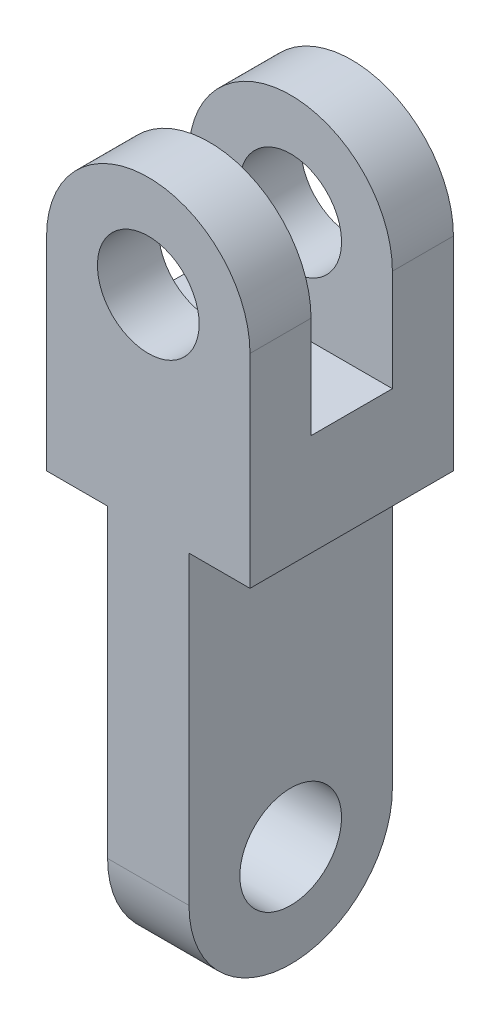
ISO-10303-21;
HEADER;
FILE_DESCRIPTION(('STEP AP214'),'2;1');
FILE_NAME('part.step','',(''),(''),'','','');
FILE_SCHEMA(('AUTOMOTIVE_DESIGN { 1 0 10303 214 1 1 1 1 }'));
ENDSEC;
DATA;
#1=APPLICATION_CONTEXT('core data for automotive mechanical design processes');
#2=APPLICATION_PROTOCOL_DEFINITION('international standard','automotive_design',2000,#1);
#3=PRODUCT_CONTEXT('',#1,'mechanical');
#4=PRODUCT('Part','Part','',(#3));
#5=PRODUCT_RELATED_PRODUCT_CATEGORY('part','',(#4));
#6=PRODUCT_DEFINITION_FORMATION('','',#4);
#7=PRODUCT_DEFINITION_CONTEXT('part definition',#1,'design');
#8=PRODUCT_DEFINITION('design','',#6,#7);
#9=PRODUCT_DEFINITION_SHAPE('','',#8);
#10=(LENGTH_UNIT() NAMED_UNIT(*) SI_UNIT(.MILLI.,.METRE.));
#11=(NAMED_UNIT(*) PLANE_ANGLE_UNIT() SI_UNIT($,.RADIAN.));
#12=(NAMED_UNIT(*) SI_UNIT($,.STERADIAN.) SOLID_ANGLE_UNIT());
#13=UNCERTAINTY_MEASURE_WITH_UNIT(LENGTH_MEASURE(1.E-05),#10,'distance_accuracy_value','');
#14=(GEOMETRIC_REPRESENTATION_CONTEXT(3) GLOBAL_UNCERTAINTY_ASSIGNED_CONTEXT((#13)) GLOBAL_UNIT_ASSIGNED_CONTEXT((#10,
#11,#12)) REPRESENTATION_CONTEXT('',''));
#15=CARTESIAN_POINT('',(0.,0.,0.));
#16=DIRECTION('',(0.,0.,1.));
#17=DIRECTION('',(1.,0.,0.));
#18=AXIS2_PLACEMENT_3D('',#15,#16,#17);
#19=CARTESIAN_POINT('',(-50.,0.,50.));
#20=DIRECTION('',(0.,1.,0.));
#21=DIRECTION('',(-1.,0.,0.));
#22=AXIS2_PLACEMENT_3D('',#19,#20,#21);
#23=PLANE('',#22);
#24=DIRECTION('',(0.,0.,1.));
#25=VECTOR('',#24,1.);
#26=CARTESIAN_POINT('',(20.,0.,-50.));
#27=LINE('',#26,#25);
#28=CARTESIAN_POINT('',(20.,0.,-50.));
#29=VERTEX_POINT('',#28);
#30=CARTESIAN_POINT('',(20.,0.,50.));
#31=VERTEX_POINT('',#30);
#32=EDGE_CURVE('E56',#29,#31,#27,.T.);
#33=ORIENTED_EDGE('',*,*,#32,.F.);
#34=DIRECTION('',(1.,0.,0.));
#35=VECTOR('',#34,1.);
#36=CARTESIAN_POINT('',(-50.,0.,-50.));
#37=LINE('',#36,#35);
#38=CARTESIAN_POINT('',(50.,0.,-50.));
#39=VERTEX_POINT('',#38);
#40=EDGE_CURVE('E215',#29,#39,#37,.T.);
#41=ORIENTED_EDGE('',*,*,#40,.T.);
#42=DIRECTION('',(0.,0.,-1.));
#43=VECTOR('',#42,1.);
#44=CARTESIAN_POINT('',(50.,0.,50.));
#45=LINE('',#44,#43);
#46=CARTESIAN_POINT('',(50.,0.,50.));
#47=VERTEX_POINT('',#46);
#48=EDGE_CURVE('E124',#47,#39,#45,.T.);
#49=ORIENTED_EDGE('',*,*,#48,.F.);
#50=DIRECTION('',(1.,0.,0.));
#51=VECTOR('',#50,1.);
#52=CARTESIAN_POINT('',(-50.,0.,50.));
#53=LINE('',#52,#51);
#54=EDGE_CURVE('E121',#31,#47,#53,.T.);
#55=ORIENTED_EDGE('',*,*,#54,.F.);
#56=EDGE_LOOP('',(#33,#41,#49,#55));
#57=FACE_BOUND('',#56,.T.);
#58=ADVANCED_FACE('F33',(#57),#23,.F.);
#59=CARTESIAN_POINT('',(0.,100.,50.));
#60=DIRECTION('',(0.,0.,-1.));
#61=DIRECTION('',(-1.,0.,0.));
#62=AXIS2_PLACEMENT_3D('',#59,#60,#61);
#63=CYLINDRICAL_SURFACE('',#62,50.);
#64=DIRECTION('',(0.,0.,-1.));
#65=VECTOR('',#64,1.);
#66=CARTESIAN_POINT('',(-50.,100.,50.));
#67=LINE('',#66,#65);
#68=CARTESIAN_POINT('',(-50.,100.,-20.));
#69=VERTEX_POINT('',#68);
#70=CARTESIAN_POINT('',(-50.,100.,-50.));
#71=VERTEX_POINT('',#70);
#72=EDGE_CURVE('E220',#69,#71,#67,.T.);
#73=ORIENTED_EDGE('',*,*,#72,.F.);
#74=CARTESIAN_POINT('',(0.,100.,-20.));
#75=DIRECTION('',(0.,0.,-1.));
#76=DIRECTION('',(-1.,0.,0.));
#77=AXIS2_PLACEMENT_3D('',#74,#75,#76);
#78=CIRCLE('',#77,50.);
#79=CARTESIAN_POINT('',(50.,100.,-20.));
#80=VERTEX_POINT('',#79);
#81=EDGE_CURVE('E168',#80,#69,#78,.F.);
#82=ORIENTED_EDGE('',*,*,#81,.F.);
#83=DIRECTION('',(0.,0.,-1.));
#84=VECTOR('',#83,1.);
#85=CARTESIAN_POINT('',(50.,100.,50.));
#86=LINE('',#85,#84);
#87=CARTESIAN_POINT('',(50.,100.,-50.));
#88=VERTEX_POINT('',#87);
#89=EDGE_CURVE('E41',#80,#88,#86,.T.);
#90=ORIENTED_EDGE('',*,*,#89,.T.);
#91=CARTESIAN_POINT('',(0.,100.,-50.));
#92=DIRECTION('',(0.,0.,1.));
#93=DIRECTION('',(1.,0.,0.));
#94=AXIS2_PLACEMENT_3D('',#91,#92,#93);
#95=CIRCLE('',#94,50.);
#96=EDGE_CURVE('E210',#88,#71,#95,.T.);
#97=ORIENTED_EDGE('',*,*,#96,.T.);
#98=EDGE_LOOP('',(#73,#82,#90,#97));
#99=FACE_BOUND('',#98,.T.);
#100=ADVANCED_FACE('F236',(#99),#63,.T.);
#101=CARTESIAN_POINT('',(0.,100.,50.));
#102=DIRECTION('',(0.,0.,-1.));
#103=DIRECTION('',(-1.,0.,0.));
#104=AXIS2_PLACEMENT_3D('',#101,#102,#103);
#105=CYLINDRICAL_SURFACE('',#104,25.);
#106=CARTESIAN_POINT('',(0.,100.,-20.));
#107=DIRECTION('',(0.,0.,-1.));
#108=DIRECTION('',(-1.,0.,0.));
#109=AXIS2_PLACEMENT_3D('',#106,#107,#108);
#110=CIRCLE('',#109,25.);
#111=CARTESIAN_POINT('',(-25.,100.,-20.));
#112=VERTEX_POINT('',#111);
#113=EDGE_CURVE('E171',#112,#112,#110,.F.);
#114=ORIENTED_EDGE('',*,*,#113,.T.);
#115=EDGE_LOOP('',(#114));
#116=FACE_BOUND('',#115,.T.);
#117=CARTESIAN_POINT('',(0.,100.,-50.));
#118=DIRECTION('',(0.,0.,1.));
#119=DIRECTION('',(1.,0.,0.));
#120=AXIS2_PLACEMENT_3D('',#117,#118,#119);
#121=CIRCLE('',#120,25.);
#122=CARTESIAN_POINT('',(25.,100.,-50.));
#123=VERTEX_POINT('',#122);
#124=EDGE_CURVE('E195',#123,#123,#121,.T.);
#125=ORIENTED_EDGE('',*,*,#124,.F.);
#126=EDGE_LOOP('',(#125));
#127=FACE_BOUND('',#126,.T.);
#128=ADVANCED_FACE('F284',(#116,#127),#105,.F.);
#129=CARTESIAN_POINT('',(0.,100.,50.));
#130=DIRECTION('',(0.,0.,1.));
#131=DIRECTION('',(1.,0.,0.));
#132=AXIS2_PLACEMENT_3D('',#129,#130,#131);
#133=PLANE('',#132);
#134=DIRECTION('',(0.,1.,0.));
#135=VECTOR('',#134,1.);
#136=CARTESIAN_POINT('',(50.,0.,50.));
#137=LINE('',#136,#135);
#138=CARTESIAN_POINT('',(50.,100.,50.));
#139=VERTEX_POINT('',#138);
#140=EDGE_CURVE('E202',#47,#139,#137,.T.);
#141=ORIENTED_EDGE('',*,*,#140,.T.);
#142=CARTESIAN_POINT('',(0.,100.,50.));
#143=DIRECTION('',(0.,0.,1.));
#144=DIRECTION('',(1.,0.,0.));
#145=AXIS2_PLACEMENT_3D('',#142,#143,#144);
#146=CIRCLE('',#145,50.);
#147=CARTESIAN_POINT('',(-50.,100.,50.));
#148=VERTEX_POINT('',#147);
#149=EDGE_CURVE('E204',#139,#148,#146,.T.);
#150=ORIENTED_EDGE('',*,*,#149,.T.);
#151=DIRECTION('',(0.,-1.,0.));
#152=VECTOR('',#151,1.);
#153=CARTESIAN_POINT('',(-50.,100.,50.));
#154=LINE('',#153,#152);
#155=CARTESIAN_POINT('',(-50.,0.,50.));
#156=VERTEX_POINT('',#155);
#157=EDGE_CURVE('E129',#148,#156,#154,.T.);
#158=ORIENTED_EDGE('',*,*,#157,.T.);
#159=CARTESIAN_POINT('',(-20.,0.,50.));
#160=VERTEX_POINT('',#159);
#161=EDGE_CURVE('E128',#156,#160,#53,.T.);
#162=ORIENTED_EDGE('',*,*,#161,.T.);
#163=DIRECTION('',(0.,-1.,0.));
#164=VECTOR('',#163,1.);
#165=CARTESIAN_POINT('',(-20.,0.,50.));
#166=LINE('',#165,#164);
#167=CARTESIAN_POINT('',(-20.,-150.,50.));
#168=VERTEX_POINT('',#167);
#169=EDGE_CURVE('E159',#160,#168,#166,.T.);
#170=ORIENTED_EDGE('',*,*,#169,.T.);
#171=DIRECTION('',(-1.,0.,0.));
#172=VECTOR('',#171,1.);
#173=CARTESIAN_POINT('',(20.,-150.,50.));
#174=LINE('',#173,#172);
#175=CARTESIAN_POINT('',(20.,-150.,50.));
#176=VERTEX_POINT('',#175);
#177=EDGE_CURVE('E136',#176,#168,#174,.T.);
#178=ORIENTED_EDGE('',*,*,#177,.F.);
#179=DIRECTION('',(0.,-1.,0.));
#180=VECTOR('',#179,1.);
#181=CARTESIAN_POINT('',(20.,0.,50.));
#182=LINE('',#181,#180);
#183=EDGE_CURVE('E132',#31,#176,#182,.T.);
#184=ORIENTED_EDGE('',*,*,#183,.F.);
#185=ORIENTED_EDGE('',*,*,#54,.T.);
#186=EDGE_LOOP('',(#141,#150,#158,#162,#170,#178,#184,#185));
#187=FACE_BOUND('',#186,.T.);
#188=CARTESIAN_POINT('',(0.,100.,50.));
#189=DIRECTION('',(0.,0.,1.));
#190=DIRECTION('',(1.,0.,0.));
#191=AXIS2_PLACEMENT_3D('',#188,#189,#190);
#192=CIRCLE('',#191,25.);
#193=CARTESIAN_POINT('',(25.,100.,50.));
#194=VERTEX_POINT('',#193);
#195=EDGE_CURVE('E196',#194,#194,#192,.T.);
#196=ORIENTED_EDGE('',*,*,#195,.F.);
#197=EDGE_LOOP('',(#196));
#198=FACE_BOUND('',#197,.T.);
#199=ADVANCED_FACE('F133',(#187,#198),#133,.T.);
#200=CARTESIAN_POINT('',(0.,100.,-50.));
#201=DIRECTION('',(0.,0.,1.));
#202=DIRECTION('',(1.,0.,0.));
#203=AXIS2_PLACEMENT_3D('',#200,#201,#202);
#204=PLANE('',#203);
#205=DIRECTION('',(0.,1.,0.));
#206=VECTOR('',#205,1.);
#207=CARTESIAN_POINT('',(50.,0.,-50.));
#208=LINE('',#207,#206);
#209=EDGE_CURVE('E199',#39,#88,#208,.T.);
#210=ORIENTED_EDGE('',*,*,#209,.F.);
#211=ORIENTED_EDGE('',*,*,#40,.F.);
#212=DIRECTION('',(0.,1.,0.));
#213=VECTOR('',#212,1.);
#214=CARTESIAN_POINT('',(20.,-150.,-50.));
#215=LINE('',#214,#213);
#216=CARTESIAN_POINT('',(20.,-150.,-50.));
#217=VERTEX_POINT('',#216);
#218=EDGE_CURVE('E145',#217,#29,#215,.T.);
#219=ORIENTED_EDGE('',*,*,#218,.F.);
#220=DIRECTION('',(-1.,0.,0.));
#221=VECTOR('',#220,1.);
#222=CARTESIAN_POINT('',(20.,-150.,-50.));
#223=LINE('',#222,#221);
#224=CARTESIAN_POINT('',(-20.,-150.,-50.));
#225=VERTEX_POINT('',#224);
#226=EDGE_CURVE('E157',#217,#225,#223,.T.);
#227=ORIENTED_EDGE('',*,*,#226,.T.);
#228=DIRECTION('',(0.,1.,0.));
#229=VECTOR('',#228,1.);
#230=CARTESIAN_POINT('',(-20.,-150.,-50.));
#231=LINE('',#230,#229);
#232=CARTESIAN_POINT('',(-20.,0.,-50.));
#233=VERTEX_POINT('',#232);
#234=EDGE_CURVE('E146',#225,#233,#231,.T.);
#235=ORIENTED_EDGE('',*,*,#234,.T.);
#236=CARTESIAN_POINT('',(-50.,0.,-50.));
#237=VERTEX_POINT('',#236);
#238=EDGE_CURVE('E205',#237,#233,#37,.T.);
#239=ORIENTED_EDGE('',*,*,#238,.F.);
#240=DIRECTION('',(0.,-1.,0.));
#241=VECTOR('',#240,1.);
#242=CARTESIAN_POINT('',(-50.,100.,-50.));
#243=LINE('',#242,#241);
#244=EDGE_CURVE('E213',#71,#237,#243,.T.);
#245=ORIENTED_EDGE('',*,*,#244,.F.);
#246=ORIENTED_EDGE('',*,*,#96,.F.);
#247=EDGE_LOOP('',(#210,#211,#219,#227,#235,#239,#245,#246));
#248=FACE_BOUND('',#247,.T.);
#249=ORIENTED_EDGE('',*,*,#124,.T.);
#250=EDGE_LOOP('',(#249));
#251=FACE_BOUND('',#250,.T.);
#252=ADVANCED_FACE('F241',(#248,#251),#204,.F.);
#253=CARTESIAN_POINT('',(50.,0.,50.));
#254=DIRECTION('',(-1.,0.,0.));
#255=DIRECTION('',(0.,-1.,0.));
#256=AXIS2_PLACEMENT_3D('',#253,#254,#255);
#257=PLANE('',#256);
#258=ORIENTED_EDGE('',*,*,#89,.F.);
#259=DIRECTION('',(0.,1.,0.));
#260=VECTOR('',#259,1.);
#261=CARTESIAN_POINT('',(50.,50.,-20.));
#262=LINE('',#261,#260);
#263=CARTESIAN_POINT('',(50.,50.,-20.));
#264=VERTEX_POINT('',#263);
#265=EDGE_CURVE('E185',#264,#80,#262,.T.);
#266=ORIENTED_EDGE('',*,*,#265,.F.);
#267=DIRECTION('',(0.,0.,-1.));
#268=VECTOR('',#267,1.);
#269=CARTESIAN_POINT('',(50.,50.,20.));
#270=LINE('',#269,#268);
#271=CARTESIAN_POINT('',(50.,50.,20.));
#272=VERTEX_POINT('',#271);
#273=EDGE_CURVE('E182',#272,#264,#270,.T.);
#274=ORIENTED_EDGE('',*,*,#273,.F.);
#275=DIRECTION('',(0.,-1.,0.));
#276=VECTOR('',#275,1.);
#277=CARTESIAN_POINT('',(50.,150.,20.));
#278=LINE('',#277,#276);
#279=CARTESIAN_POINT('',(50.,100.,20.));
#280=VERTEX_POINT('',#279);
#281=EDGE_CURVE('E179',#280,#272,#278,.T.);
#282=ORIENTED_EDGE('',*,*,#281,.F.);
#283=EDGE_CURVE('E11',#139,#280,#86,.T.);
#284=ORIENTED_EDGE('',*,*,#283,.F.);
#285=ORIENTED_EDGE('',*,*,#140,.F.);
#286=ORIENTED_EDGE('',*,*,#48,.T.);
#287=ORIENTED_EDGE('',*,*,#209,.T.);
#288=EDGE_LOOP('',(#258,#266,#274,#282,#284,#285,#286,#287));
#289=FACE_BOUND('',#288,.T.);
#290=ADVANCED_FACE('F35',(#289),#257,.F.);
#291=ORIENTED_EDGE('',*,*,#283,.T.);
#292=CARTESIAN_POINT('',(0.,100.,20.));
#293=DIRECTION('',(0.,0.,1.));
#294=DIRECTION('',(1.,0.,0.));
#295=AXIS2_PLACEMENT_3D('',#292,#293,#294);
#296=CIRCLE('',#295,50.);
#297=CARTESIAN_POINT('',(-50.,100.,20.));
#298=VERTEX_POINT('',#297);
#299=EDGE_CURVE('E166',#298,#280,#296,.F.);
#300=ORIENTED_EDGE('',*,*,#299,.F.);
#301=EDGE_CURVE('E221',#148,#298,#67,.T.);
#302=ORIENTED_EDGE('',*,*,#301,.F.);
#303=ORIENTED_EDGE('',*,*,#149,.F.);
#304=EDGE_LOOP('',(#291,#300,#302,#303));
#305=FACE_BOUND('',#304,.T.);
#306=ADVANCED_FACE('F249',(#305),#63,.T.);
#307=CARTESIAN_POINT('',(-50.,100.,50.));
#308=DIRECTION('',(1.,0.,0.));
#309=DIRECTION('',(0.,1.,0.));
#310=AXIS2_PLACEMENT_3D('',#307,#308,#309);
#311=PLANE('',#310);
#312=DIRECTION('',(0.,0.,1.));
#313=VECTOR('',#312,1.);
#314=CARTESIAN_POINT('',(-50.,50.,20.));
#315=LINE('',#314,#313);
#316=CARTESIAN_POINT('',(-50.,50.,-20.));
#317=VERTEX_POINT('',#316);
#318=CARTESIAN_POINT('',(-50.,50.,20.));
#319=VERTEX_POINT('',#318);
#320=EDGE_CURVE('E174',#317,#319,#315,.T.);
#321=ORIENTED_EDGE('',*,*,#320,.F.);
#322=DIRECTION('',(0.,-1.,0.));
#323=VECTOR('',#322,1.);
#324=CARTESIAN_POINT('',(-50.,50.,-20.));
#325=LINE('',#324,#323);
#326=EDGE_CURVE('E177',#69,#317,#325,.T.);
#327=ORIENTED_EDGE('',*,*,#326,.F.);
#328=ORIENTED_EDGE('',*,*,#72,.T.);
#329=ORIENTED_EDGE('',*,*,#244,.T.);
#330=DIRECTION('',(0.,0.,-1.));
#331=VECTOR('',#330,1.);
#332=CARTESIAN_POINT('',(-50.,0.,50.));
#333=LINE('',#332,#331);
#334=EDGE_CURVE('E218',#156,#237,#333,.T.);
#335=ORIENTED_EDGE('',*,*,#334,.F.);
#336=ORIENTED_EDGE('',*,*,#157,.F.);
#337=ORIENTED_EDGE('',*,*,#301,.T.);
#338=DIRECTION('',(0.,1.,0.));
#339=VECTOR('',#338,1.);
#340=CARTESIAN_POINT('',(-50.,150.,20.));
#341=LINE('',#340,#339);
#342=EDGE_CURVE('E190',#319,#298,#341,.T.);
#343=ORIENTED_EDGE('',*,*,#342,.F.);
#344=EDGE_LOOP('',(#321,#327,#328,#329,#335,#336,#337,#343));
#345=FACE_BOUND('',#344,.T.);
#346=ADVANCED_FACE('F230',(#345),#311,.F.);
#347=ORIENTED_EDGE('',*,*,#238,.T.);
#348=DIRECTION('',(0.,0.,1.));
#349=VECTOR('',#348,1.);
#350=CARTESIAN_POINT('',(-20.,0.,-50.));
#351=LINE('',#350,#349);
#352=EDGE_CURVE('E48',#233,#160,#351,.T.);
#353=ORIENTED_EDGE('',*,*,#352,.T.);
#354=ORIENTED_EDGE('',*,*,#161,.F.);
#355=ORIENTED_EDGE('',*,*,#334,.T.);
#356=EDGE_LOOP('',(#347,#353,#354,#355));
#357=FACE_BOUND('',#356,.T.);
#358=ADVANCED_FACE('F244',(#357),#23,.F.);
#359=CARTESIAN_POINT('',(0.,100.,20.));
#360=DIRECTION('',(0.,0.,1.));
#361=DIRECTION('',(1.,0.,0.));
#362=AXIS2_PLACEMENT_3D('',#359,#360,#361);
#363=CIRCLE('',#362,25.);
#364=CARTESIAN_POINT('',(25.,100.,20.));
#365=VERTEX_POINT('',#364);
#366=EDGE_CURVE('E170',#365,#365,#363,.F.);
#367=ORIENTED_EDGE('',*,*,#366,.T.);
#368=EDGE_LOOP('',(#367));
#369=FACE_BOUND('',#368,.T.);
#370=ORIENTED_EDGE('',*,*,#195,.T.);
#371=EDGE_LOOP('',(#370));
#372=FACE_BOUND('',#371,.T.);
#373=ADVANCED_FACE('F288',(#369,#372),#105,.F.);
#374=CARTESIAN_POINT('',(-50.0010000000001,50.,-20.));
#375=DIRECTION('',(0.,0.,-1.));
#376=DIRECTION('',(-1.,0.,0.));
#377=AXIS2_PLACEMENT_3D('',#374,#375,#376);
#378=PLANE('',#377);
#379=ORIENTED_EDGE('',*,*,#113,.F.);
#380=EDGE_LOOP('',(#379));
#381=FACE_BOUND('',#380,.T.);
#382=ORIENTED_EDGE('',*,*,#81,.T.);
#383=ORIENTED_EDGE('',*,*,#326,.T.);
#384=DIRECTION('',(1.,0.,0.));
#385=VECTOR('',#384,1.);
#386=CARTESIAN_POINT('',(-50.0010000000001,50.,-20.));
#387=LINE('',#386,#385);
#388=EDGE_CURVE('E188',#317,#264,#387,.T.);
#389=ORIENTED_EDGE('',*,*,#388,.T.);
#390=ORIENTED_EDGE('',*,*,#265,.T.);
#391=EDGE_LOOP('',(#382,#383,#389,#390));
#392=FACE_BOUND('',#391,.T.);
#393=ADVANCED_FACE('F260',(#381,#392),#378,.F.);
#394=CARTESIAN_POINT('',(-50.0010000000001,50.,20.));
#395=DIRECTION('',(0.,-1.,0.));
#396=DIRECTION('',(1.,0.,0.));
#397=AXIS2_PLACEMENT_3D('',#394,#395,#396);
#398=PLANE('',#397);
#399=ORIENTED_EDGE('',*,*,#320,.T.);
#400=DIRECTION('',(1.,0.,0.));
#401=VECTOR('',#400,1.);
#402=CARTESIAN_POINT('',(-50.0010000000001,50.,20.));
#403=LINE('',#402,#401);
#404=EDGE_CURVE('E187',#319,#272,#403,.T.);
#405=ORIENTED_EDGE('',*,*,#404,.T.);
#406=ORIENTED_EDGE('',*,*,#273,.T.);
#407=ORIENTED_EDGE('',*,*,#388,.F.);
#408=EDGE_LOOP('',(#399,#405,#406,#407));
#409=FACE_BOUND('',#408,.T.);
#410=ADVANCED_FACE('F258',(#409),#398,.F.);
#411=CARTESIAN_POINT('',(-50.0010000000001,150.,20.));
#412=DIRECTION('',(0.,0.,1.));
#413=DIRECTION('',(1.,0.,0.));
#414=AXIS2_PLACEMENT_3D('',#411,#412,#413);
#415=PLANE('',#414);
#416=ORIENTED_EDGE('',*,*,#366,.F.);
#417=EDGE_LOOP('',(#416));
#418=FACE_BOUND('',#417,.T.);
#419=ORIENTED_EDGE('',*,*,#281,.T.);
#420=ORIENTED_EDGE('',*,*,#404,.F.);
#421=ORIENTED_EDGE('',*,*,#342,.T.);
#422=ORIENTED_EDGE('',*,*,#299,.T.);
#423=EDGE_LOOP('',(#419,#420,#421,#422));
#424=FACE_BOUND('',#423,.T.);
#425=ADVANCED_FACE('F252',(#418,#424),#415,.F.);
#426=CARTESIAN_POINT('',(20.,-150.,0.));
#427=DIRECTION('',(1.,0.,0.));
#428=DIRECTION('',(0.,0.,-1.));
#429=AXIS2_PLACEMENT_3D('',#426,#427,#428);
#430=PLANE('',#429);
#431=ORIENTED_EDGE('',*,*,#32,.T.);
#432=ORIENTED_EDGE('',*,*,#183,.T.);
#433=CARTESIAN_POINT('',(20.,-150.,0.));
#434=DIRECTION('',(1.,0.,0.));
#435=DIRECTION('',(0.,0.,-1.));
#436=AXIS2_PLACEMENT_3D('',#433,#434,#435);
#437=CIRCLE('',#436,50.);
#438=EDGE_CURVE('E139',#176,#217,#437,.T.);
#439=ORIENTED_EDGE('',*,*,#438,.T.);
#440=ORIENTED_EDGE('',*,*,#218,.T.);
#441=EDGE_LOOP('',(#431,#432,#439,#440));
#442=FACE_BOUND('',#441,.T.);
#443=CARTESIAN_POINT('',(20.,-150.,0.));
#444=DIRECTION('',(1.,0.,0.));
#445=DIRECTION('',(0.,0.,-1.));
#446=AXIS2_PLACEMENT_3D('',#443,#444,#445);
#447=CIRCLE('',#446,25.);
#448=CARTESIAN_POINT('',(20.,-150.,-25.));
#449=VERTEX_POINT('',#448);
#450=EDGE_CURVE('E160',#449,#449,#447,.T.);
#451=ORIENTED_EDGE('',*,*,#450,.F.);
#452=EDGE_LOOP('',(#451));
#453=FACE_BOUND('',#452,.T.);
#454=ADVANCED_FACE('F142',(#442,#453),#430,.T.);
#455=CARTESIAN_POINT('',(-20.,-150.,0.));
#456=DIRECTION('',(1.,0.,0.));
#457=DIRECTION('',(0.,0.,-1.));
#458=AXIS2_PLACEMENT_3D('',#455,#456,#457);
#459=PLANE('',#458);
#460=ORIENTED_EDGE('',*,*,#352,.F.);
#461=ORIENTED_EDGE('',*,*,#234,.F.);
#462=CARTESIAN_POINT('',(-20.,-150.,0.));
#463=DIRECTION('',(1.,0.,0.));
#464=DIRECTION('',(0.,0.,-1.));
#465=AXIS2_PLACEMENT_3D('',#462,#463,#464);
#466=CIRCLE('',#465,50.);
#467=EDGE_CURVE('E149',#168,#225,#466,.T.);
#468=ORIENTED_EDGE('',*,*,#467,.F.);
#469=ORIENTED_EDGE('',*,*,#169,.F.);
#470=EDGE_LOOP('',(#460,#461,#468,#469));
#471=FACE_BOUND('',#470,.T.);
#472=CARTESIAN_POINT('',(-20.,-150.,0.));
#473=DIRECTION('',(1.,0.,0.));
#474=DIRECTION('',(0.,0.,-1.));
#475=AXIS2_PLACEMENT_3D('',#472,#473,#474);
#476=CIRCLE('',#475,25.);
#477=CARTESIAN_POINT('',(-20.,-150.,-25.));
#478=VERTEX_POINT('',#477);
#479=EDGE_CURVE('E152',#478,#478,#476,.T.);
#480=ORIENTED_EDGE('',*,*,#479,.T.);
#481=EDGE_LOOP('',(#480));
#482=FACE_BOUND('',#481,.T.);
#483=ADVANCED_FACE('F265',(#471,#482),#459,.F.);
#484=CARTESIAN_POINT('',(20.,-150.,0.));
#485=DIRECTION('',(-1.,0.,0.));
#486=DIRECTION('',(0.,0.,1.));
#487=AXIS2_PLACEMENT_3D('',#484,#485,#486);
#488=CYLINDRICAL_SURFACE('',#487,50.);
#489=ORIENTED_EDGE('',*,*,#467,.T.);
#490=ORIENTED_EDGE('',*,*,#226,.F.);
#491=ORIENTED_EDGE('',*,*,#438,.F.);
#492=ORIENTED_EDGE('',*,*,#177,.T.);
#493=EDGE_LOOP('',(#489,#490,#491,#492));
#494=FACE_BOUND('',#493,.T.);
#495=ADVANCED_FACE('F267',(#494),#488,.T.);
#496=CARTESIAN_POINT('',(20.,-150.,0.));
#497=DIRECTION('',(-1.,0.,0.));
#498=DIRECTION('',(0.,0.,1.));
#499=AXIS2_PLACEMENT_3D('',#496,#497,#498);
#500=CYLINDRICAL_SURFACE('',#499,25.);
#501=ORIENTED_EDGE('',*,*,#450,.T.);
#502=EDGE_LOOP('',(#501));
#503=FACE_BOUND('',#502,.T.);
#504=ORIENTED_EDGE('',*,*,#479,.F.);
#505=EDGE_LOOP('',(#504));
#506=FACE_BOUND('',#505,.T.);
#507=ADVANCED_FACE('F269',(#503,#506),#500,.F.);
#508=CLOSED_SHELL('',(#58,#100,#128,#199,#252,#290,#306,#346,#358,#373,#393,#410,#425,#454,#483,
#495,#507));
#509=MANIFOLD_SOLID_BREP('B2',#508);
#510=ADVANCED_BREP_SHAPE_REPRESENTATION('',(#18,#509),#14);
#511=SHAPE_DEFINITION_REPRESENTATION(#9,#510);
ENDSEC;
END-ISO-10303-21;
